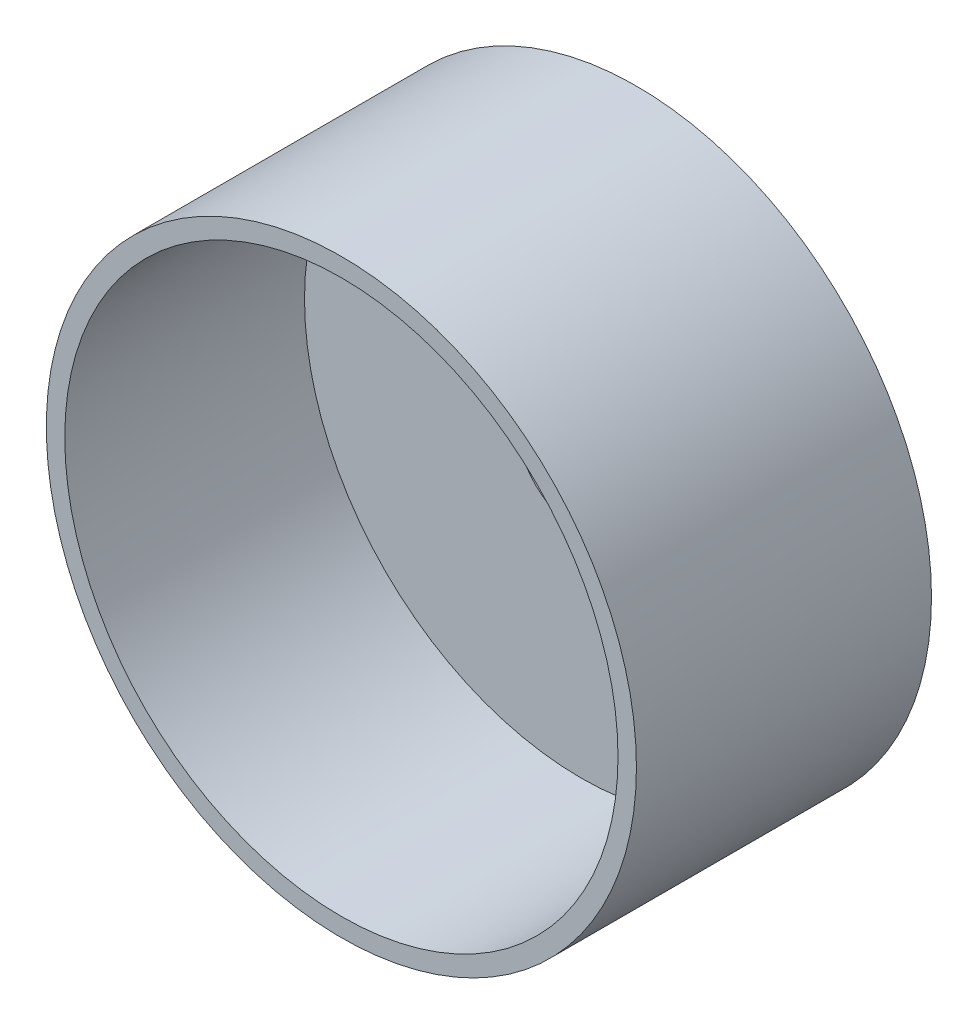
ISO-10303-21;
HEADER;
FILE_DESCRIPTION(('STEP AP214'),'2;1');
FILE_NAME('part.step','',(''),(''),'','','');
FILE_SCHEMA(('AUTOMOTIVE_DESIGN { 1 0 10303 214 1 1 1 1 }'));
ENDSEC;
DATA;
#1=APPLICATION_CONTEXT('core data for automotive mechanical design processes');
#2=APPLICATION_PROTOCOL_DEFINITION('international standard','automotive_design',2000,#1);
#3=PRODUCT_CONTEXT('',#1,'mechanical');
#4=PRODUCT('Part','Part','',(#3));
#5=PRODUCT_RELATED_PRODUCT_CATEGORY('part','',(#4));
#6=PRODUCT_DEFINITION_FORMATION('','',#4);
#7=PRODUCT_DEFINITION_CONTEXT('part definition',#1,'design');
#8=PRODUCT_DEFINITION('design','',#6,#7);
#9=PRODUCT_DEFINITION_SHAPE('','',#8);
#10=(LENGTH_UNIT() NAMED_UNIT(*) SI_UNIT(.MILLI.,.METRE.));
#11=(NAMED_UNIT(*) PLANE_ANGLE_UNIT() SI_UNIT($,.RADIAN.));
#12=(NAMED_UNIT(*) SI_UNIT($,.STERADIAN.) SOLID_ANGLE_UNIT());
#13=UNCERTAINTY_MEASURE_WITH_UNIT(LENGTH_MEASURE(1.E-05),#10,'distance_accuracy_value','');
#14=(GEOMETRIC_REPRESENTATION_CONTEXT(3) GLOBAL_UNCERTAINTY_ASSIGNED_CONTEXT((#13)) GLOBAL_UNIT_ASSIGNED_CONTEXT((#10,
#11,#12)) REPRESENTATION_CONTEXT('',''));
#15=CARTESIAN_POINT('',(0.,0.,0.));
#16=DIRECTION('',(0.,0.,1.));
#17=DIRECTION('',(1.,0.,0.));
#18=AXIS2_PLACEMENT_3D('',#15,#16,#17);
#19=CARTESIAN_POINT('',(190.5,0.,0.));
#20=DIRECTION('',(0.,0.,1.));
#21=DIRECTION('',(1.,0.,0.));
#22=AXIS2_PLACEMENT_3D('',#19,#20,#21);
#23=PLANE('',#22);
#24=CARTESIAN_POINT('',(0.,0.,0.));
#25=DIRECTION('',(0.,0.,1.));
#26=DIRECTION('',(1.,0.,0.));
#27=AXIS2_PLACEMENT_3D('',#24,#25,#26);
#28=CIRCLE('',#27,190.5);
#29=CARTESIAN_POINT('',(190.5,0.,0.));
#30=VERTEX_POINT('',#29);
#31=EDGE_CURVE('E59',#30,#30,#28,.T.);
#32=ORIENTED_EDGE('',*,*,#31,.T.);
#33=EDGE_LOOP('',(#32));
#34=FACE_BOUND('',#33,.T.);
#35=CARTESIAN_POINT('',(0.,0.,0.));
#36=DIRECTION('',(0.,0.,1.));
#37=DIRECTION('',(1.,0.,0.));
#38=AXIS2_PLACEMENT_3D('',#35,#36,#37);
#39=CIRCLE('',#38,44.45);
#40=CARTESIAN_POINT('',(44.45,0.,0.));
#41=VERTEX_POINT('',#40);
#42=EDGE_CURVE('E10',#41,#41,#39,.T.);
#43=ORIENTED_EDGE('',*,*,#42,.F.);
#44=EDGE_LOOP('',(#43));
#45=FACE_BOUND('',#44,.T.);
#46=ADVANCED_FACE('F31',(#34,#45),#23,.T.);
#47=CARTESIAN_POINT('',(0.,0.,0.));
#48=DIRECTION('',(0.,0.,1.));
#49=DIRECTION('',(1.,0.,0.));
#50=AXIS2_PLACEMENT_3D('',#47,#48,#49);
#51=CYLINDRICAL_SURFACE('',#50,44.45);
#52=ORIENTED_EDGE('',*,*,#42,.T.);
#53=EDGE_LOOP('',(#52));
#54=FACE_BOUND('',#53,.T.);
#55=CARTESIAN_POINT('',(0.,0.,-44.45));
#56=DIRECTION('',(0.,0.,1.));
#57=DIRECTION('',(1.,0.,0.));
#58=AXIS2_PLACEMENT_3D('',#55,#56,#57);
#59=CIRCLE('',#58,44.45);
#60=CARTESIAN_POINT('',(44.45,0.,-44.45));
#61=VERTEX_POINT('',#60);
#62=EDGE_CURVE('E37',#61,#61,#59,.T.);
#63=ORIENTED_EDGE('',*,*,#62,.F.);
#64=EDGE_LOOP('',(#63));
#65=FACE_BOUND('',#64,.T.);
#66=ADVANCED_FACE('F77',(#54,#65),#51,.F.);
#67=CARTESIAN_POINT('',(44.45,0.,-44.45));
#68=DIRECTION('',(0.,0.,-1.));
#69=DIRECTION('',(-1.,0.,0.));
#70=AXIS2_PLACEMENT_3D('',#67,#68,#69);
#71=PLANE('',#70);
#72=ORIENTED_EDGE('',*,*,#62,.T.);
#73=EDGE_LOOP('',(#72));
#74=FACE_BOUND('',#73,.T.);
#75=CARTESIAN_POINT('',(0.,0.,-44.45));
#76=DIRECTION('',(0.,0.,1.));
#77=DIRECTION('',(1.,0.,0.));
#78=AXIS2_PLACEMENT_3D('',#75,#76,#77);
#79=CIRCLE('',#78,152.4);
#80=CARTESIAN_POINT('',(152.4,0.,-44.45));
#81=VERTEX_POINT('',#80);
#82=EDGE_CURVE('E41',#81,#81,#79,.T.);
#83=ORIENTED_EDGE('',*,*,#82,.F.);
#84=EDGE_LOOP('',(#83));
#85=FACE_BOUND('',#84,.T.);
#86=ADVANCED_FACE('F81',(#74,#85),#71,.T.);
#87=CARTESIAN_POINT('',(0.,0.,0.));
#88=DIRECTION('',(0.,0.,1.));
#89=DIRECTION('',(1.,0.,0.));
#90=AXIS2_PLACEMENT_3D('',#87,#88,#89);
#91=CYLINDRICAL_SURFACE('',#90,152.4);
#92=ORIENTED_EDGE('',*,*,#82,.T.);
#93=EDGE_LOOP('',(#92));
#94=FACE_BOUND('',#93,.T.);
#95=CARTESIAN_POINT('',(0.,0.,-38.1));
#96=DIRECTION('',(0.,0.,1.));
#97=DIRECTION('',(1.,0.,0.));
#98=AXIS2_PLACEMENT_3D('',#95,#96,#97);
#99=CIRCLE('',#98,152.4);
#100=CARTESIAN_POINT('',(152.4,0.,-38.1));
#101=VERTEX_POINT('',#100);
#102=EDGE_CURVE('E45',#101,#101,#99,.T.);
#103=ORIENTED_EDGE('',*,*,#102,.F.);
#104=EDGE_LOOP('',(#103));
#105=FACE_BOUND('',#104,.T.);
#106=ADVANCED_FACE('F85',(#94,#105),#91,.T.);
#107=CARTESIAN_POINT('',(152.4,0.,-38.1));
#108=DIRECTION('',(0.,0.,-1.));
#109=DIRECTION('',(-1.,0.,0.));
#110=AXIS2_PLACEMENT_3D('',#107,#108,#109);
#111=PLANE('',#110);
#112=ORIENTED_EDGE('',*,*,#102,.T.);
#113=EDGE_LOOP('',(#112));
#114=FACE_BOUND('',#113,.T.);
#115=CARTESIAN_POINT('',(0.,0.,-38.1));
#116=DIRECTION('',(0.,0.,1.));
#117=DIRECTION('',(1.,0.,0.));
#118=AXIS2_PLACEMENT_3D('',#115,#116,#117);
#119=CIRCLE('',#118,203.2);
#120=CARTESIAN_POINT('',(203.2,0.,-38.1));
#121=VERTEX_POINT('',#120);
#122=EDGE_CURVE('E50',#121,#121,#119,.T.);
#123=ORIENTED_EDGE('',*,*,#122,.F.);
#124=EDGE_LOOP('',(#123));
#125=FACE_BOUND('',#124,.T.);
#126=ADVANCED_FACE('F91',(#114,#125),#111,.T.);
#127=CARTESIAN_POINT('',(0.,0.,0.));
#128=DIRECTION('',(0.,0.,1.));
#129=DIRECTION('',(1.,0.,0.));
#130=AXIS2_PLACEMENT_3D('',#127,#128,#129);
#131=CYLINDRICAL_SURFACE('',#130,203.2);
#132=ORIENTED_EDGE('',*,*,#122,.T.);
#133=EDGE_LOOP('',(#132));
#134=FACE_BOUND('',#133,.T.);
#135=CARTESIAN_POINT('',(0.,0.,165.1));
#136=DIRECTION('',(0.,0.,1.));
#137=DIRECTION('',(1.,0.,0.));
#138=AXIS2_PLACEMENT_3D('',#135,#136,#137);
#139=CIRCLE('',#138,203.2);
#140=CARTESIAN_POINT('',(203.2,0.,165.1));
#141=VERTEX_POINT('',#140);
#142=EDGE_CURVE('E53',#141,#141,#139,.T.);
#143=ORIENTED_EDGE('',*,*,#142,.F.);
#144=EDGE_LOOP('',(#143));
#145=FACE_BOUND('',#144,.T.);
#146=ADVANCED_FACE('F73',(#134,#145),#131,.T.);
#147=CARTESIAN_POINT('',(203.2,0.,165.1));
#148=DIRECTION('',(0.,0.,1.));
#149=DIRECTION('',(1.,0.,0.));
#150=AXIS2_PLACEMENT_3D('',#147,#148,#149);
#151=PLANE('',#150);
#152=ORIENTED_EDGE('',*,*,#142,.T.);
#153=EDGE_LOOP('',(#152));
#154=FACE_BOUND('',#153,.T.);
#155=CARTESIAN_POINT('',(0.,0.,165.1));
#156=DIRECTION('',(0.,0.,1.));
#157=DIRECTION('',(1.,0.,0.));
#158=AXIS2_PLACEMENT_3D('',#155,#156,#157);
#159=CIRCLE('',#158,190.5);
#160=CARTESIAN_POINT('',(190.5,0.,165.1));
#161=VERTEX_POINT('',#160);
#162=EDGE_CURVE('E56',#161,#161,#159,.T.);
#163=ORIENTED_EDGE('',*,*,#162,.F.);
#164=EDGE_LOOP('',(#163));
#165=FACE_BOUND('',#164,.T.);
#166=ADVANCED_FACE('F67',(#154,#165),#151,.T.);
#167=CARTESIAN_POINT('',(0.,0.,0.));
#168=DIRECTION('',(0.,0.,1.));
#169=DIRECTION('',(1.,0.,0.));
#170=AXIS2_PLACEMENT_3D('',#167,#168,#169);
#171=CYLINDRICAL_SURFACE('',#170,190.5);
#172=ORIENTED_EDGE('',*,*,#162,.T.);
#173=EDGE_LOOP('',(#172));
#174=FACE_BOUND('',#173,.T.);
#175=ORIENTED_EDGE('',*,*,#31,.F.);
#176=EDGE_LOOP('',(#175));
#177=FACE_BOUND('',#176,.T.);
#178=ADVANCED_FACE('F65',(#174,#177),#171,.F.);
#179=CLOSED_SHELL('',(#46,#66,#86,#106,#126,#146,#166,#178));
#180=MANIFOLD_SOLID_BREP('B2',#179);
#181=ADVANCED_BREP_SHAPE_REPRESENTATION('',(#18,#180),#14);
#182=SHAPE_DEFINITION_REPRESENTATION(#9,#181);
ENDSEC;
END-ISO-10303-21;
